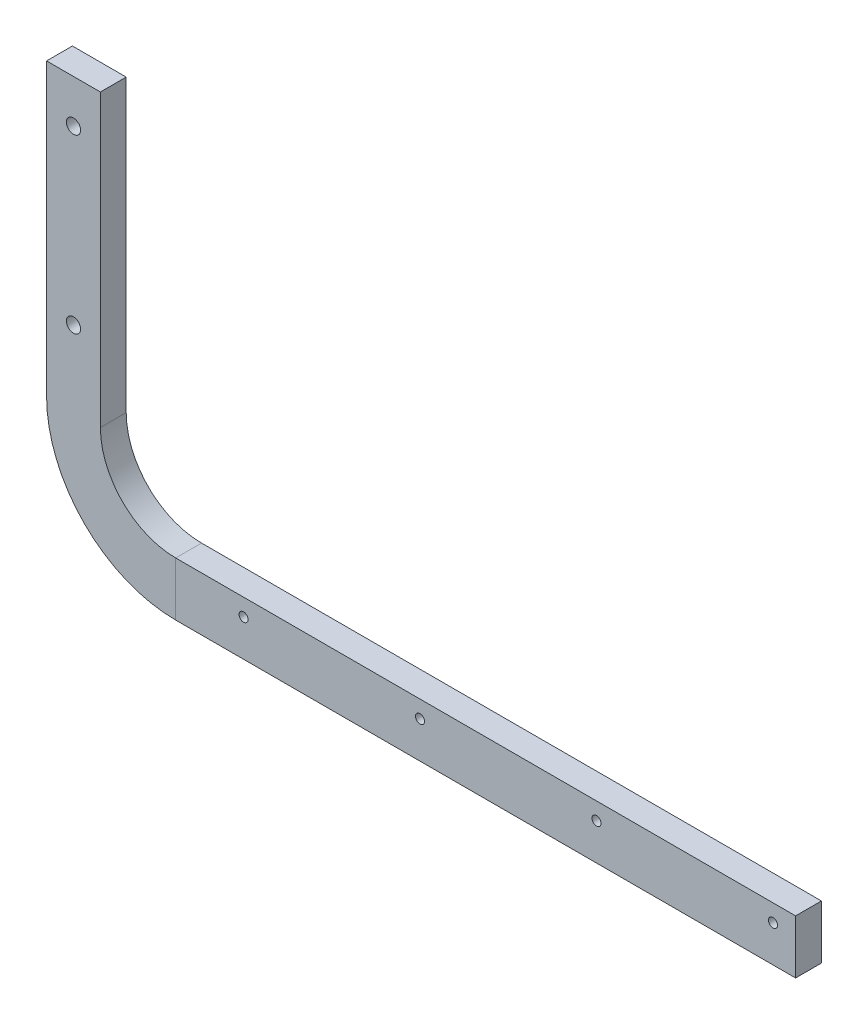
ISO-10303-21;
HEADER;
FILE_DESCRIPTION(('STEP AP214'),'2;1');
FILE_NAME('part.step','',(''),(''),'','','');
FILE_SCHEMA(('AUTOMOTIVE_DESIGN { 1 0 10303 214 1 1 1 1 }'));
ENDSEC;
DATA;
#1=APPLICATION_CONTEXT('core data for automotive mechanical design processes');
#2=APPLICATION_PROTOCOL_DEFINITION('international standard','automotive_design',2000,#1);
#3=PRODUCT_CONTEXT('',#1,'mechanical');
#4=PRODUCT('Part','Part','',(#3));
#5=PRODUCT_RELATED_PRODUCT_CATEGORY('part','',(#4));
#6=PRODUCT_DEFINITION_FORMATION('','',#4);
#7=PRODUCT_DEFINITION_CONTEXT('part definition',#1,'design');
#8=PRODUCT_DEFINITION('design','',#6,#7);
#9=PRODUCT_DEFINITION_SHAPE('','',#8);
#10=(LENGTH_UNIT() NAMED_UNIT(*) SI_UNIT(.MILLI.,.METRE.));
#11=(NAMED_UNIT(*) PLANE_ANGLE_UNIT() SI_UNIT($,.RADIAN.));
#12=(NAMED_UNIT(*) SI_UNIT($,.STERADIAN.) SOLID_ANGLE_UNIT());
#13=UNCERTAINTY_MEASURE_WITH_UNIT(LENGTH_MEASURE(1.E-05),#10,'distance_accuracy_value','');
#14=(GEOMETRIC_REPRESENTATION_CONTEXT(3) GLOBAL_UNCERTAINTY_ASSIGNED_CONTEXT((#13)) GLOBAL_UNIT_ASSIGNED_CONTEXT((#10,
#11,#12)) REPRESENTATION_CONTEXT('',''));
#15=CARTESIAN_POINT('',(0.,0.,0.));
#16=DIRECTION('',(0.,0.,1.));
#17=DIRECTION('',(1.,0.,0.));
#18=AXIS2_PLACEMENT_3D('',#15,#16,#17);
#19=CARTESIAN_POINT('',(91.4999999999995,-178.,6.));
#20=DIRECTION('',(0.,0.,1.));
#21=DIRECTION('',(1.,0.,0.));
#22=AXIS2_PLACEMENT_3D('',#19,#20,#21);
#23=CYLINDRICAL_SURFACE('',#22,2.09999999999999);
#24=CARTESIAN_POINT('',(91.4999999999995,-178.,-6.));
#25=DIRECTION('',(0.,0.,1.));
#26=DIRECTION('',(1.,0.,0.));
#27=AXIS2_PLACEMENT_3D('',#24,#25,#26);
#28=CIRCLE('',#27,2.09999999999999);
#29=CARTESIAN_POINT('',(93.5999999999995,-178.,-6.));
#30=VERTEX_POINT('',#29);
#31=EDGE_CURVE('E52',#30,#30,#28,.T.);
#32=ORIENTED_EDGE('',*,*,#31,.F.);
#33=EDGE_LOOP('',(#32));
#34=FACE_BOUND('',#33,.T.);
#35=CARTESIAN_POINT('',(91.4999999999995,-178.,6.));
#36=DIRECTION('',(0.,0.,1.));
#37=DIRECTION('',(1.,0.,0.));
#38=AXIS2_PLACEMENT_3D('',#35,#36,#37);
#39=CIRCLE('',#38,2.09999999999999);
#40=CARTESIAN_POINT('',(93.5999999999995,-178.,6.));
#41=VERTEX_POINT('',#40);
#42=EDGE_CURVE('E11',#41,#41,#39,.T.);
#43=ORIENTED_EDGE('',*,*,#42,.T.);
#44=EDGE_LOOP('',(#43));
#45=FACE_BOUND('',#44,.T.);
#46=ADVANCED_FACE('F45',(#34,#45),#23,.F.);
#47=CARTESIAN_POINT('',(173.499999999999,-178.,6.));
#48=DIRECTION('',(0.,0.,1.));
#49=DIRECTION('',(1.,0.,0.));
#50=AXIS2_PLACEMENT_3D('',#47,#48,#49);
#51=CYLINDRICAL_SURFACE('',#50,2.09999999999999);
#52=CARTESIAN_POINT('',(173.499999999999,-178.,-6.));
#53=DIRECTION('',(0.,0.,1.));
#54=DIRECTION('',(1.,0.,0.));
#55=AXIS2_PLACEMENT_3D('',#52,#53,#54);
#56=CIRCLE('',#55,2.09999999999999);
#57=CARTESIAN_POINT('',(175.599999999999,-178.,-6.));
#58=VERTEX_POINT('',#57);
#59=EDGE_CURVE('E150',#58,#58,#56,.T.);
#60=ORIENTED_EDGE('',*,*,#59,.F.);
#61=EDGE_LOOP('',(#60));
#62=FACE_BOUND('',#61,.T.);
#63=CARTESIAN_POINT('',(173.499999999999,-178.,6.));
#64=DIRECTION('',(0.,0.,1.));
#65=DIRECTION('',(1.,0.,0.));
#66=AXIS2_PLACEMENT_3D('',#63,#64,#65);
#67=CIRCLE('',#66,2.09999999999999);
#68=CARTESIAN_POINT('',(175.599999999999,-178.,6.));
#69=VERTEX_POINT('',#68);
#70=EDGE_CURVE('E153',#69,#69,#67,.T.);
#71=ORIENTED_EDGE('',*,*,#70,.T.);
#72=EDGE_LOOP('',(#71));
#73=FACE_BOUND('',#72,.T.);
#74=ADVANCED_FACE('F162',(#62,#73),#51,.F.);
#75=CARTESIAN_POINT('',(60.,-135.,6.));
#76=DIRECTION('',(0.,0.,1.));
#77=DIRECTION('',(1.,0.,0.));
#78=AXIS2_PLACEMENT_3D('',#75,#76,#77);
#79=PLANE('',#78);
#80=CARTESIAN_POINT('',(12.5,-20.0000000000001,6.));
#81=DIRECTION('',(0.,0.,1.));
#82=DIRECTION('',(1.,0.,0.));
#83=AXIS2_PLACEMENT_3D('',#80,#81,#82);
#84=CIRCLE('',#83,3.3);
#85=CARTESIAN_POINT('',(15.8,-20.0000000000001,6.));
#86=VERTEX_POINT('',#85);
#87=EDGE_CURVE('E195',#86,#86,#84,.T.);
#88=ORIENTED_EDGE('',*,*,#87,.F.);
#89=EDGE_LOOP('',(#88));
#90=FACE_BOUND('',#89,.T.);
#91=CARTESIAN_POINT('',(12.4999999999993,-100.,6.));
#92=DIRECTION('',(0.,0.,1.));
#93=DIRECTION('',(1.,0.,0.));
#94=AXIS2_PLACEMENT_3D('',#91,#92,#93);
#95=CIRCLE('',#94,3.3);
#96=CARTESIAN_POINT('',(15.7999999999993,-100.,6.));
#97=VERTEX_POINT('',#96);
#98=EDGE_CURVE('E198',#97,#97,#95,.T.);
#99=ORIENTED_EDGE('',*,*,#98,.F.);
#100=EDGE_LOOP('',(#99));
#101=FACE_BOUND('',#100,.T.);
#102=CARTESIAN_POINT('',(60.,-135.,6.));
#103=DIRECTION('',(0.,0.,1.));
#104=DIRECTION('',(1.,0.,0.));
#105=AXIS2_PLACEMENT_3D('',#102,#103,#104);
#106=CIRCLE('',#105,60.);
#107=CARTESIAN_POINT('',(0.,-135.,6.));
#108=VERTEX_POINT('',#107);
#109=CARTESIAN_POINT('',(60.,-195.,6.));
#110=VERTEX_POINT('',#109);
#111=EDGE_CURVE('E125',#108,#110,#106,.T.);
#112=ORIENTED_EDGE('',*,*,#111,.T.);
#113=DIRECTION('',(0.,1.,0.));
#114=VECTOR('',#113,1.);
#115=CARTESIAN_POINT('',(60.,-135.,6.));
#116=LINE('',#115,#114);
#117=CARTESIAN_POINT('',(60.,-170.,6.));
#118=VERTEX_POINT('',#117);
#119=EDGE_CURVE('E142',#110,#118,#116,.T.);
#120=ORIENTED_EDGE('',*,*,#119,.T.);
#121=CARTESIAN_POINT('',(60.,-135.,6.));
#122=DIRECTION('',(0.,0.,-1.));
#123=DIRECTION('',(-1.,0.,0.));
#124=AXIS2_PLACEMENT_3D('',#121,#122,#123);
#125=CIRCLE('',#124,35.);
#126=CARTESIAN_POINT('',(25.,-135.,6.));
#127=VERTEX_POINT('',#126);
#128=EDGE_CURVE('E217',#118,#127,#125,.T.);
#129=ORIENTED_EDGE('',*,*,#128,.T.);
#130=DIRECTION('',(0.,1.,0.));
#131=VECTOR('',#130,1.);
#132=CARTESIAN_POINT('',(25.,-135.,6.));
#133=LINE('',#132,#131);
#134=CARTESIAN_POINT('',(25.,0.,6.));
#135=VERTEX_POINT('',#134);
#136=EDGE_CURVE('E131',#127,#135,#133,.T.);
#137=ORIENTED_EDGE('',*,*,#136,.T.);
#138=DIRECTION('',(-1.,0.,0.));
#139=VECTOR('',#138,1.);
#140=CARTESIAN_POINT('',(25.,0.,6.));
#141=LINE('',#140,#139);
#142=CARTESIAN_POINT('',(0.,0.,6.));
#143=VERTEX_POINT('',#142);
#144=EDGE_CURVE('E126',#135,#143,#141,.T.);
#145=ORIENTED_EDGE('',*,*,#144,.T.);
#146=DIRECTION('',(0.,-1.,0.));
#147=VECTOR('',#146,1.);
#148=CARTESIAN_POINT('',(0.,0.,6.));
#149=LINE('',#148,#147);
#150=EDGE_CURVE('E113',#143,#108,#149,.T.);
#151=ORIENTED_EDGE('',*,*,#150,.T.);
#152=EDGE_LOOP('',(#112,#120,#129,#137,#145,#151));
#153=FACE_BOUND('',#152,.T.);
#154=ADVANCED_FACE('F129',(#90,#101,#153),#79,.T.);
#155=CARTESIAN_POINT('',(60.,-135.,-6.));
#156=DIRECTION('',(0.,0.,1.));
#157=DIRECTION('',(1.,0.,0.));
#158=AXIS2_PLACEMENT_3D('',#155,#156,#157);
#159=PLANE('',#158);
#160=CARTESIAN_POINT('',(255.499999999999,-178.,-6.));
#161=DIRECTION('',(0.,0.,1.));
#162=DIRECTION('',(1.,0.,0.));
#163=AXIS2_PLACEMENT_3D('',#160,#161,#162);
#164=CIRCLE('',#163,2.09999999999999);
#165=CARTESIAN_POINT('',(257.599999999999,-178.,-6.));
#166=VERTEX_POINT('',#165);
#167=EDGE_CURVE('E445',#166,#166,#164,.T.);
#168=ORIENTED_EDGE('',*,*,#167,.T.);
#169=EDGE_LOOP('',(#168));
#170=FACE_BOUND('',#169,.T.);
#171=CARTESIAN_POINT('',(337.499999999999,-178.,-6.));
#172=DIRECTION('',(0.,0.,1.));
#173=DIRECTION('',(1.,0.,0.));
#174=AXIS2_PLACEMENT_3D('',#171,#172,#173);
#175=CIRCLE('',#174,2.09999999999999);
#176=CARTESIAN_POINT('',(339.599999999999,-178.,-6.));
#177=VERTEX_POINT('',#176);
#178=EDGE_CURVE('E435',#177,#177,#175,.T.);
#179=ORIENTED_EDGE('',*,*,#178,.T.);
#180=EDGE_LOOP('',(#179));
#181=FACE_BOUND('',#180,.T.);
#182=DIRECTION('',(-1.,0.,0.));
#183=VECTOR('',#182,1.);
#184=CARTESIAN_POINT('',(60.,-116.604888099516,-6.));
#185=LINE('',#184,#183);
#186=CARTESIAN_POINT('',(25.,-116.604888099516,-6.));
#187=VERTEX_POINT('',#186);
#188=CARTESIAN_POINT('',(0.,-116.604888099516,-6.));
#189=VERTEX_POINT('',#188);
#190=EDGE_CURVE('E59',#187,#189,#185,.T.);
#191=ORIENTED_EDGE('',*,*,#190,.F.);
#192=DIRECTION('',(0.,1.,0.));
#193=VECTOR('',#192,1.);
#194=CARTESIAN_POINT('',(25.,-135.,-6.));
#195=LINE('',#194,#193);
#196=CARTESIAN_POINT('',(25.,-135.,-6.));
#197=VERTEX_POINT('',#196);
#198=EDGE_CURVE('E135',#197,#187,#195,.T.);
#199=ORIENTED_EDGE('',*,*,#198,.F.);
#200=CARTESIAN_POINT('',(60.,-135.,-6.));
#201=DIRECTION('',(0.,0.,-1.));
#202=DIRECTION('',(-1.,0.,0.));
#203=AXIS2_PLACEMENT_3D('',#200,#201,#202);
#204=CIRCLE('',#203,35.);
#205=CARTESIAN_POINT('',(60.,-170.,-6.));
#206=VERTEX_POINT('',#205);
#207=EDGE_CURVE('E233',#206,#197,#204,.T.);
#208=ORIENTED_EDGE('',*,*,#207,.F.);
#209=DIRECTION('',(-1.,0.,0.));
#210=VECTOR('',#209,1.);
#211=CARTESIAN_POINT('',(348.,-170.,-6.));
#212=LINE('',#211,#210);
#213=CARTESIAN_POINT('',(348.,-170.,-6.));
#214=VERTEX_POINT('',#213);
#215=EDGE_CURVE('E231',#214,#206,#212,.T.);
#216=ORIENTED_EDGE('',*,*,#215,.F.);
#217=DIRECTION('',(0.,1.,0.));
#218=VECTOR('',#217,1.);
#219=CARTESIAN_POINT('',(348.,-195.,-6.));
#220=LINE('',#219,#218);
#221=CARTESIAN_POINT('',(348.,-195.,-6.));
#222=VERTEX_POINT('',#221);
#223=EDGE_CURVE('E229',#222,#214,#220,.T.);
#224=ORIENTED_EDGE('',*,*,#223,.F.);
#225=DIRECTION('',(1.,0.,0.));
#226=VECTOR('',#225,1.);
#227=CARTESIAN_POINT('',(60.,-195.,-6.));
#228=LINE('',#227,#226);
#229=CARTESIAN_POINT('',(60.,-195.,-6.));
#230=VERTEX_POINT('',#229);
#231=EDGE_CURVE('E227',#230,#222,#228,.T.);
#232=ORIENTED_EDGE('',*,*,#231,.F.);
#233=CARTESIAN_POINT('',(60.,-135.,-6.));
#234=DIRECTION('',(0.,0.,1.));
#235=DIRECTION('',(1.,0.,0.));
#236=AXIS2_PLACEMENT_3D('',#233,#234,#235);
#237=CIRCLE('',#236,60.);
#238=CARTESIAN_POINT('',(0.,-135.,-6.));
#239=VERTEX_POINT('',#238);
#240=EDGE_CURVE('E225',#239,#230,#237,.T.);
#241=ORIENTED_EDGE('',*,*,#240,.F.);
#242=DIRECTION('',(0.,-1.,0.));
#243=VECTOR('',#242,1.);
#244=CARTESIAN_POINT('',(0.,0.,-6.));
#245=LINE('',#244,#243);
#246=EDGE_CURVE('E222',#189,#239,#245,.T.);
#247=ORIENTED_EDGE('',*,*,#246,.F.);
#248=EDGE_LOOP('',(#191,#199,#208,#216,#224,#232,#241,#247));
#249=FACE_BOUND('',#248,.T.);
#250=ORIENTED_EDGE('',*,*,#59,.T.);
#251=EDGE_LOOP('',(#250));
#252=FACE_BOUND('',#251,.T.);
#253=ORIENTED_EDGE('',*,*,#31,.T.);
#254=EDGE_LOOP('',(#253));
#255=FACE_BOUND('',#254,.T.);
#256=ADVANCED_FACE('F158',(#170,#181,#249,#252,#255),#159,.F.);
#257=CARTESIAN_POINT('',(25.,0.,6.));
#258=DIRECTION('',(0.,-1.,0.));
#259=DIRECTION('',(1.,0.,0.));
#260=AXIS2_PLACEMENT_3D('',#257,#258,#259);
#261=PLANE('',#260);
#262=DIRECTION('',(-1.,0.,0.));
#263=VECTOR('',#262,1.);
#264=CARTESIAN_POINT('',(25.,0.,-6.));
#265=LINE('',#264,#263);
#266=CARTESIAN_POINT('',(25.,0.,-6.));
#267=VERTEX_POINT('',#266);
#268=CARTESIAN_POINT('',(0.,0.,-6.));
#269=VERTEX_POINT('',#268);
#270=EDGE_CURVE('E139',#267,#269,#265,.T.);
#271=ORIENTED_EDGE('',*,*,#270,.T.);
#272=DIRECTION('',(0.,0.,-1.));
#273=VECTOR('',#272,1.);
#274=CARTESIAN_POINT('',(0.,0.,6.));
#275=LINE('',#274,#273);
#276=EDGE_CURVE('E118',#143,#269,#275,.T.);
#277=ORIENTED_EDGE('',*,*,#276,.F.);
#278=ORIENTED_EDGE('',*,*,#144,.F.);
#279=DIRECTION('',(0.,0.,-1.));
#280=VECTOR('',#279,1.);
#281=CARTESIAN_POINT('',(25.,0.,6.));
#282=LINE('',#281,#280);
#283=EDGE_CURVE('E220',#135,#267,#282,.T.);
#284=ORIENTED_EDGE('',*,*,#283,.T.);
#285=EDGE_LOOP('',(#271,#277,#278,#284));
#286=FACE_BOUND('',#285,.T.);
#287=ADVANCED_FACE('F137',(#286),#261,.F.);
#288=CARTESIAN_POINT('',(0.,0.,6.));
#289=DIRECTION('',(1.,0.,0.));
#290=DIRECTION('',(0.,1.,0.));
#291=AXIS2_PLACEMENT_3D('',#288,#289,#290);
#292=PLANE('',#291);
#293=EDGE_CURVE('E223',#269,#189,#245,.T.);
#294=ORIENTED_EDGE('',*,*,#293,.T.);
#295=ORIENTED_EDGE('',*,*,#246,.T.);
#296=DIRECTION('',(0.,0.,-1.));
#297=VECTOR('',#296,1.);
#298=CARTESIAN_POINT('',(0.,-135.,6.));
#299=LINE('',#298,#297);
#300=EDGE_CURVE('E121',#108,#239,#299,.T.);
#301=ORIENTED_EDGE('',*,*,#300,.F.);
#302=ORIENTED_EDGE('',*,*,#150,.F.);
#303=ORIENTED_EDGE('',*,*,#276,.T.);
#304=EDGE_LOOP('',(#294,#295,#301,#302,#303));
#305=FACE_BOUND('',#304,.T.);
#306=ADVANCED_FACE('F116',(#305),#292,.F.);
#307=CARTESIAN_POINT('',(60.,-135.,6.));
#308=DIRECTION('',(0.,0.,-1.));
#309=DIRECTION('',(-1.,0.,0.));
#310=AXIS2_PLACEMENT_3D('',#307,#308,#309);
#311=CYLINDRICAL_SURFACE('',#310,60.);
#312=ORIENTED_EDGE('',*,*,#240,.T.);
#313=DIRECTION('',(0.,0.,-1.));
#314=VECTOR('',#313,1.);
#315=CARTESIAN_POINT('',(60.,-195.,6.));
#316=LINE('',#315,#314);
#317=EDGE_CURVE('E144',#110,#230,#316,.T.);
#318=ORIENTED_EDGE('',*,*,#317,.F.);
#319=ORIENTED_EDGE('',*,*,#111,.F.);
#320=ORIENTED_EDGE('',*,*,#300,.T.);
#321=EDGE_LOOP('',(#312,#318,#319,#320));
#322=FACE_BOUND('',#321,.T.);
#323=ADVANCED_FACE('F274',(#322),#311,.T.);
#324=CARTESIAN_POINT('',(60.,-195.,6.));
#325=DIRECTION('',(0.,1.,0.));
#326=DIRECTION('',(0.,0.,1.));
#327=AXIS2_PLACEMENT_3D('',#324,#325,#326);
#328=PLANE('',#327);
#329=ORIENTED_EDGE('',*,*,#231,.T.);
#330=DIRECTION('',(0.,0.,-1.));
#331=VECTOR('',#330,1.);
#332=CARTESIAN_POINT('',(348.,-195.,6.));
#333=LINE('',#332,#331);
#334=CARTESIAN_POINT('',(348.,-195.,6.));
#335=VERTEX_POINT('',#334);
#336=EDGE_CURVE('E248',#335,#222,#333,.T.);
#337=ORIENTED_EDGE('',*,*,#336,.F.);
#338=DIRECTION('',(1.,0.,0.));
#339=VECTOR('',#338,1.);
#340=CARTESIAN_POINT('',(60.,-195.,6.));
#341=LINE('',#340,#339);
#342=EDGE_CURVE('E210',#110,#335,#341,.T.);
#343=ORIENTED_EDGE('',*,*,#342,.F.);
#344=ORIENTED_EDGE('',*,*,#317,.T.);
#345=EDGE_LOOP('',(#329,#337,#343,#344));
#346=FACE_BOUND('',#345,.T.);
#347=ADVANCED_FACE('F255',(#346),#328,.F.);
#348=CARTESIAN_POINT('',(348.,-195.,6.));
#349=DIRECTION('',(-1.,0.,0.));
#350=DIRECTION('',(0.,0.,1.));
#351=AXIS2_PLACEMENT_3D('',#348,#349,#350);
#352=PLANE('',#351);
#353=ORIENTED_EDGE('',*,*,#223,.T.);
#354=DIRECTION('',(0.,0.,-1.));
#355=VECTOR('',#354,1.);
#356=CARTESIAN_POINT('',(348.,-170.,6.));
#357=LINE('',#356,#355);
#358=CARTESIAN_POINT('',(348.,-170.,6.));
#359=VERTEX_POINT('',#358);
#360=EDGE_CURVE('E245',#359,#214,#357,.T.);
#361=ORIENTED_EDGE('',*,*,#360,.F.);
#362=DIRECTION('',(0.,1.,0.));
#363=VECTOR('',#362,1.);
#364=CARTESIAN_POINT('',(348.,-195.,6.));
#365=LINE('',#364,#363);
#366=EDGE_CURVE('E212',#335,#359,#365,.T.);
#367=ORIENTED_EDGE('',*,*,#366,.F.);
#368=ORIENTED_EDGE('',*,*,#336,.T.);
#369=EDGE_LOOP('',(#353,#361,#367,#368));
#370=FACE_BOUND('',#369,.T.);
#371=ADVANCED_FACE('F265',(#370),#352,.F.);
#372=CARTESIAN_POINT('',(348.,-170.,6.));
#373=DIRECTION('',(0.,-1.,0.));
#374=DIRECTION('',(1.,0.,0.));
#375=AXIS2_PLACEMENT_3D('',#372,#373,#374);
#376=PLANE('',#375);
#377=ORIENTED_EDGE('',*,*,#215,.T.);
#378=DIRECTION('',(0.,0.,-1.));
#379=VECTOR('',#378,1.);
#380=CARTESIAN_POINT('',(60.,-170.,6.));
#381=LINE('',#380,#379);
#382=EDGE_CURVE('E242',#118,#206,#381,.T.);
#383=ORIENTED_EDGE('',*,*,#382,.F.);
#384=DIRECTION('',(-1.,0.,0.));
#385=VECTOR('',#384,1.);
#386=CARTESIAN_POINT('',(348.,-170.,6.));
#387=LINE('',#386,#385);
#388=EDGE_CURVE('E214',#359,#118,#387,.T.);
#389=ORIENTED_EDGE('',*,*,#388,.F.);
#390=ORIENTED_EDGE('',*,*,#360,.T.);
#391=EDGE_LOOP('',(#377,#383,#389,#390));
#392=FACE_BOUND('',#391,.T.);
#393=ADVANCED_FACE('F269',(#392),#376,.F.);
#394=CARTESIAN_POINT('',(60.,-135.,6.));
#395=DIRECTION('',(0.,0.,-1.));
#396=DIRECTION('',(-1.,0.,0.));
#397=AXIS2_PLACEMENT_3D('',#394,#395,#396);
#398=CYLINDRICAL_SURFACE('',#397,35.);
#399=ORIENTED_EDGE('',*,*,#207,.T.);
#400=DIRECTION('',(0.,0.,-1.));
#401=VECTOR('',#400,1.);
#402=CARTESIAN_POINT('',(25.,-135.,6.));
#403=LINE('',#402,#401);
#404=EDGE_CURVE('E239',#127,#197,#403,.T.);
#405=ORIENTED_EDGE('',*,*,#404,.F.);
#406=ORIENTED_EDGE('',*,*,#128,.F.);
#407=ORIENTED_EDGE('',*,*,#382,.T.);
#408=EDGE_LOOP('',(#399,#405,#406,#407));
#409=FACE_BOUND('',#408,.T.);
#410=ADVANCED_FACE('F178',(#409),#398,.F.);
#411=CARTESIAN_POINT('',(25.,-135.,6.));
#412=DIRECTION('',(-1.,0.,0.));
#413=DIRECTION('',(0.,0.,1.));
#414=AXIS2_PLACEMENT_3D('',#411,#412,#413);
#415=PLANE('',#414);
#416=ORIENTED_EDGE('',*,*,#198,.T.);
#417=EDGE_CURVE('E235',#187,#267,#195,.T.);
#418=ORIENTED_EDGE('',*,*,#417,.T.);
#419=ORIENTED_EDGE('',*,*,#283,.F.);
#420=ORIENTED_EDGE('',*,*,#136,.F.);
#421=ORIENTED_EDGE('',*,*,#404,.T.);
#422=EDGE_LOOP('',(#416,#418,#419,#420,#421));
#423=FACE_BOUND('',#422,.T.);
#424=ADVANCED_FACE('F168',(#423),#415,.F.);
#425=CARTESIAN_POINT('',(255.499999999999,-178.,6.));
#426=DIRECTION('',(0.,0.,1.));
#427=DIRECTION('',(1.,0.,0.));
#428=AXIS2_PLACEMENT_3D('',#425,#426,#427);
#429=CIRCLE('',#428,2.09999999999999);
#430=CARTESIAN_POINT('',(257.599999999999,-178.,6.));
#431=VERTEX_POINT('',#430);
#432=EDGE_CURVE('E442',#431,#431,#429,.T.);
#433=ORIENTED_EDGE('',*,*,#432,.F.);
#434=EDGE_LOOP('',(#433));
#435=FACE_BOUND('',#434,.T.);
#436=CARTESIAN_POINT('',(337.499999999999,-178.,6.));
#437=DIRECTION('',(0.,0.,1.));
#438=DIRECTION('',(1.,0.,0.));
#439=AXIS2_PLACEMENT_3D('',#436,#437,#438);
#440=CIRCLE('',#439,2.09999999999999);
#441=CARTESIAN_POINT('',(339.599999999999,-178.,6.));
#442=VERTEX_POINT('',#441);
#443=EDGE_CURVE('E437',#442,#442,#440,.T.);
#444=ORIENTED_EDGE('',*,*,#443,.F.);
#445=EDGE_LOOP('',(#444));
#446=FACE_BOUND('',#445,.T.);
#447=ORIENTED_EDGE('',*,*,#119,.F.);
#448=ORIENTED_EDGE('',*,*,#342,.T.);
#449=ORIENTED_EDGE('',*,*,#366,.T.);
#450=ORIENTED_EDGE('',*,*,#388,.T.);
#451=EDGE_LOOP('',(#447,#448,#449,#450));
#452=FACE_BOUND('',#451,.T.);
#453=ORIENTED_EDGE('',*,*,#70,.F.);
#454=EDGE_LOOP('',(#453));
#455=FACE_BOUND('',#454,.T.);
#456=ORIENTED_EDGE('',*,*,#42,.F.);
#457=EDGE_LOOP('',(#456));
#458=FACE_BOUND('',#457,.T.);
#459=ADVANCED_FACE('F165',(#435,#446,#452,#455,#458),#79,.T.);
#460=CARTESIAN_POINT('',(12.5,-20.0000000000001,-6.));
#461=DIRECTION('',(0.,0.,1.));
#462=DIRECTION('',(1.,0.,0.));
#463=AXIS2_PLACEMENT_3D('',#460,#461,#462);
#464=CIRCLE('',#463,3.3);
#465=CARTESIAN_POINT('',(15.8,-20.0000000000001,-6.));
#466=VERTEX_POINT('',#465);
#467=EDGE_CURVE('E201',#466,#466,#464,.T.);
#468=ORIENTED_EDGE('',*,*,#467,.T.);
#469=EDGE_LOOP('',(#468));
#470=FACE_BOUND('',#469,.T.);
#471=CARTESIAN_POINT('',(12.4999999999993,-100.,-6.));
#472=DIRECTION('',(0.,0.,1.));
#473=DIRECTION('',(1.,0.,0.));
#474=AXIS2_PLACEMENT_3D('',#471,#472,#473);
#475=CIRCLE('',#474,3.3);
#476=CARTESIAN_POINT('',(15.7999999999993,-100.,-6.));
#477=VERTEX_POINT('',#476);
#478=EDGE_CURVE('E200',#477,#477,#475,.T.);
#479=ORIENTED_EDGE('',*,*,#478,.T.);
#480=EDGE_LOOP('',(#479));
#481=FACE_BOUND('',#480,.T.);
#482=ORIENTED_EDGE('',*,*,#417,.F.);
#483=ORIENTED_EDGE('',*,*,#190,.T.);
#484=ORIENTED_EDGE('',*,*,#293,.F.);
#485=ORIENTED_EDGE('',*,*,#270,.F.);
#486=EDGE_LOOP('',(#482,#483,#484,#485));
#487=FACE_BOUND('',#486,.T.);
#488=ADVANCED_FACE('F167',(#470,#481,#487),#159,.F.);
#489=CARTESIAN_POINT('',(12.4999999999993,-100.,6.));
#490=DIRECTION('',(0.,0.,1.));
#491=DIRECTION('',(1.,0.,0.));
#492=AXIS2_PLACEMENT_3D('',#489,#490,#491);
#493=CYLINDRICAL_SURFACE('',#492,3.3);
#494=ORIENTED_EDGE('',*,*,#478,.F.);
#495=EDGE_LOOP('',(#494));
#496=FACE_BOUND('',#495,.T.);
#497=ORIENTED_EDGE('',*,*,#98,.T.);
#498=EDGE_LOOP('',(#497));
#499=FACE_BOUND('',#498,.T.);
#500=ADVANCED_FACE('F175',(#496,#499),#493,.F.);
#501=CARTESIAN_POINT('',(12.5,-20.0000000000001,6.));
#502=DIRECTION('',(0.,0.,1.));
#503=DIRECTION('',(1.,0.,0.));
#504=AXIS2_PLACEMENT_3D('',#501,#502,#503);
#505=CYLINDRICAL_SURFACE('',#504,3.3);
#506=ORIENTED_EDGE('',*,*,#467,.F.);
#507=EDGE_LOOP('',(#506));
#508=FACE_BOUND('',#507,.T.);
#509=ORIENTED_EDGE('',*,*,#87,.T.);
#510=EDGE_LOOP('',(#509));
#511=FACE_BOUND('',#510,.T.);
#512=ADVANCED_FACE('F301',(#508,#511),#505,.F.);
#513=CARTESIAN_POINT('',(337.499999999999,-178.,6.));
#514=DIRECTION('',(0.,0.,1.));
#515=DIRECTION('',(1.,0.,0.));
#516=AXIS2_PLACEMENT_3D('',#513,#514,#515);
#517=CYLINDRICAL_SURFACE('',#516,2.09999999999999);
#518=ORIENTED_EDGE('',*,*,#178,.F.);
#519=EDGE_LOOP('',(#518));
#520=FACE_BOUND('',#519,.T.);
#521=ORIENTED_EDGE('',*,*,#443,.T.);
#522=EDGE_LOOP('',(#521));
#523=FACE_BOUND('',#522,.T.);
#524=ADVANCED_FACE('F329',(#520,#523),#517,.F.);
#525=CARTESIAN_POINT('',(255.499999999999,-178.,6.));
#526=DIRECTION('',(0.,0.,1.));
#527=DIRECTION('',(1.,0.,0.));
#528=AXIS2_PLACEMENT_3D('',#525,#526,#527);
#529=CYLINDRICAL_SURFACE('',#528,2.09999999999999);
#530=ORIENTED_EDGE('',*,*,#167,.F.);
#531=EDGE_LOOP('',(#530));
#532=FACE_BOUND('',#531,.T.);
#533=ORIENTED_EDGE('',*,*,#432,.T.);
#534=EDGE_LOOP('',(#533));
#535=FACE_BOUND('',#534,.T.);
#536=ADVANCED_FACE('F335',(#532,#535),#529,.F.);
#537=CLOSED_SHELL('',(#46,#74,#154,#256,#287,#306,#323,#347,#371,#393,#410,#424,#459,#488,#500,
#512,#524,#536));
#538=MANIFOLD_SOLID_BREP('B2',#537);
#539=ADVANCED_BREP_SHAPE_REPRESENTATION('',(#18,#538),#14);
#540=SHAPE_DEFINITION_REPRESENTATION(#9,#539);
ENDSEC;
END-ISO-10303-21;
